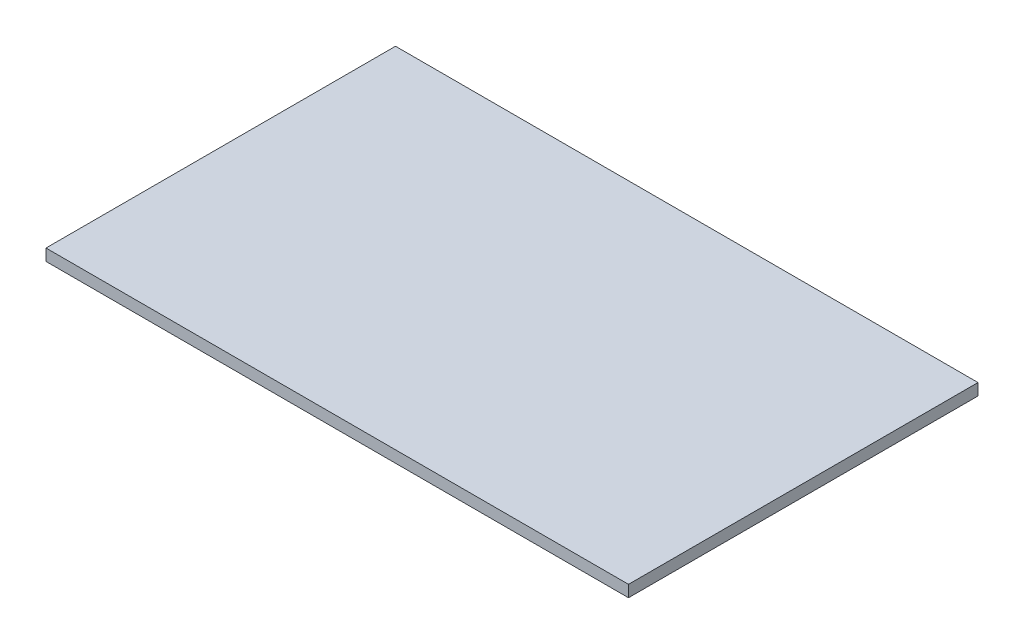
ISO-10303-21;
HEADER;
FILE_DESCRIPTION(('STEP AP214'),'2;1');
FILE_NAME('part.step','',(''),(''),'','','');
FILE_SCHEMA(('AUTOMOTIVE_DESIGN { 1 0 10303 214 1 1 1 1 }'));
ENDSEC;
DATA;
#1=APPLICATION_CONTEXT('core data for automotive mechanical design processes');
#2=APPLICATION_PROTOCOL_DEFINITION('international standard','automotive_design',2000,#1);
#3=PRODUCT_CONTEXT('',#1,'mechanical');
#4=PRODUCT('Part','Part','',(#3));
#5=PRODUCT_RELATED_PRODUCT_CATEGORY('part','',(#4));
#6=PRODUCT_DEFINITION_FORMATION('','',#4);
#7=PRODUCT_DEFINITION_CONTEXT('part definition',#1,'design');
#8=PRODUCT_DEFINITION('design','',#6,#7);
#9=PRODUCT_DEFINITION_SHAPE('','',#8);
#10=(LENGTH_UNIT() NAMED_UNIT(*) SI_UNIT(.MILLI.,.METRE.));
#11=(NAMED_UNIT(*) PLANE_ANGLE_UNIT() SI_UNIT($,.RADIAN.));
#12=(NAMED_UNIT(*) SI_UNIT($,.STERADIAN.) SOLID_ANGLE_UNIT());
#13=UNCERTAINTY_MEASURE_WITH_UNIT(LENGTH_MEASURE(1.E-05),#10,'distance_accuracy_value','');
#14=(GEOMETRIC_REPRESENTATION_CONTEXT(3) GLOBAL_UNCERTAINTY_ASSIGNED_CONTEXT((#13)) GLOBAL_UNIT_ASSIGNED_CONTEXT((#10,
#11,#12)) REPRESENTATION_CONTEXT('',''));
#15=CARTESIAN_POINT('',(0.,0.,0.));
#16=DIRECTION('',(0.,0.,1.));
#17=DIRECTION('',(1.,0.,0.));
#18=AXIS2_PLACEMENT_3D('',#15,#16,#17);
#19=CARTESIAN_POINT('',(-55.030735917634,2.54,-27.9430679789023));
#20=DIRECTION('',(0.,0.,-1.));
#21=DIRECTION('',(-1.,0.,0.));
#22=AXIS2_PLACEMENT_3D('',#19,#20,#21);
#23=PLANE('',#22);
#24=DIRECTION('',(1.,0.,0.));
#25=VECTOR('',#24,1.);
#26=CARTESIAN_POINT('',(-55.030735917634,0.,-27.9430679789023));
#27=LINE('',#26,#25);
#28=CARTESIAN_POINT('',(-55.030735917634,0.,-27.9430679789023));
#29=VERTEX_POINT('',#28);
#30=CARTESIAN_POINT('',(71.969264082366,0.,-27.9430679789023));
#31=VERTEX_POINT('',#30);
#32=EDGE_CURVE('E99',#29,#31,#27,.T.);
#33=ORIENTED_EDGE('',*,*,#32,.F.);
#34=DIRECTION('',(0.,-1.,0.));
#35=VECTOR('',#34,1.);
#36=CARTESIAN_POINT('',(-55.030735917634,2.54,-27.9430679789023));
#37=LINE('',#36,#35);
#38=CARTESIAN_POINT('',(-55.030735917634,2.54,-27.9430679789023));
#39=VERTEX_POINT('',#38);
#40=EDGE_CURVE('E11',#39,#29,#37,.T.);
#41=ORIENTED_EDGE('',*,*,#40,.F.);
#42=DIRECTION('',(1.,0.,0.));
#43=VECTOR('',#42,1.);
#44=CARTESIAN_POINT('',(-55.030735917634,2.54,-27.9430679789023));
#45=LINE('',#44,#43);
#46=CARTESIAN_POINT('',(71.969264082366,2.54,-27.9430679789023));
#47=VERTEX_POINT('',#46);
#48=EDGE_CURVE('E94',#39,#47,#45,.T.);
#49=ORIENTED_EDGE('',*,*,#48,.T.);
#50=DIRECTION('',(0.,-1.,0.));
#51=VECTOR('',#50,1.);
#52=CARTESIAN_POINT('',(71.969264082366,2.54,-27.9430679789023));
#53=LINE('',#52,#51);
#54=EDGE_CURVE('E37',#47,#31,#53,.T.);
#55=ORIENTED_EDGE('',*,*,#54,.T.);
#56=EDGE_LOOP('',(#33,#41,#49,#55));
#57=FACE_BOUND('',#56,.T.);
#58=ADVANCED_FACE('F34',(#57),#23,.T.);
#59=CARTESIAN_POINT('',(-55.030735917634,2.54,-27.9430679789023));
#60=DIRECTION('',(1.,0.,0.));
#61=DIRECTION('',(0.,0.,-1.));
#62=AXIS2_PLACEMENT_3D('',#59,#60,#61);
#63=PLANE('',#62);
#64=DIRECTION('',(0.,0.,1.));
#65=VECTOR('',#64,1.);
#66=CARTESIAN_POINT('',(-55.030735917634,0.,-27.9430679789023));
#67=LINE('',#66,#65);
#68=CARTESIAN_POINT('',(-55.030735917634,0.,48.2569320210978));
#69=VERTEX_POINT('',#68);
#70=EDGE_CURVE('E67',#29,#69,#67,.T.);
#71=ORIENTED_EDGE('',*,*,#70,.T.);
#72=DIRECTION('',(0.,-1.,0.));
#73=VECTOR('',#72,1.);
#74=CARTESIAN_POINT('',(-55.030735917634,2.54,48.2569320210978));
#75=LINE('',#74,#73);
#76=CARTESIAN_POINT('',(-55.030735917634,2.54,48.2569320210978));
#77=VERTEX_POINT('',#76);
#78=EDGE_CURVE('E43',#77,#69,#75,.T.);
#79=ORIENTED_EDGE('',*,*,#78,.F.);
#80=DIRECTION('',(0.,0.,1.));
#81=VECTOR('',#80,1.);
#82=CARTESIAN_POINT('',(-55.030735917634,2.54,-27.9430679789023));
#83=LINE('',#82,#81);
#84=EDGE_CURVE('E84',#39,#77,#83,.T.);
#85=ORIENTED_EDGE('',*,*,#84,.F.);
#86=ORIENTED_EDGE('',*,*,#40,.T.);
#87=EDGE_LOOP('',(#71,#79,#85,#86));
#88=FACE_BOUND('',#87,.T.);
#89=ADVANCED_FACE('F109',(#88),#63,.F.);
#90=CARTESIAN_POINT('',(-55.030735917634,2.54,48.2569320210978));
#91=DIRECTION('',(0.,0.,-1.));
#92=DIRECTION('',(-1.,0.,0.));
#93=AXIS2_PLACEMENT_3D('',#90,#91,#92);
#94=PLANE('',#93);
#95=DIRECTION('',(1.,0.,0.));
#96=VECTOR('',#95,1.);
#97=CARTESIAN_POINT('',(-55.030735917634,0.,48.2569320210978));
#98=LINE('',#97,#96);
#99=CARTESIAN_POINT('',(71.969264082366,0.,48.2569320210978));
#100=VERTEX_POINT('',#99);
#101=EDGE_CURVE('E91',#69,#100,#98,.T.);
#102=ORIENTED_EDGE('',*,*,#101,.T.);
#103=DIRECTION('',(0.,-1.,0.));
#104=VECTOR('',#103,1.);
#105=CARTESIAN_POINT('',(71.969264082366,2.54,48.2569320210978));
#106=LINE('',#105,#104);
#107=CARTESIAN_POINT('',(71.969264082366,2.54,48.2569320210978));
#108=VERTEX_POINT('',#107);
#109=EDGE_CURVE('E88',#108,#100,#106,.T.);
#110=ORIENTED_EDGE('',*,*,#109,.F.);
#111=DIRECTION('',(1.,0.,0.));
#112=VECTOR('',#111,1.);
#113=CARTESIAN_POINT('',(-55.030735917634,2.54,48.2569320210978));
#114=LINE('',#113,#112);
#115=EDGE_CURVE('E79',#77,#108,#114,.T.);
#116=ORIENTED_EDGE('',*,*,#115,.F.);
#117=ORIENTED_EDGE('',*,*,#78,.T.);
#118=EDGE_LOOP('',(#102,#110,#116,#117));
#119=FACE_BOUND('',#118,.T.);
#120=ADVANCED_FACE('F89',(#119),#94,.F.);
#121=CARTESIAN_POINT('',(71.969264082366,2.54,-27.9430679789023));
#122=DIRECTION('',(1.,0.,0.));
#123=DIRECTION('',(0.,0.,-1.));
#124=AXIS2_PLACEMENT_3D('',#121,#122,#123);
#125=PLANE('',#124);
#126=DIRECTION('',(0.,0.,1.));
#127=VECTOR('',#126,1.);
#128=CARTESIAN_POINT('',(71.969264082366,0.,-27.9430679789023));
#129=LINE('',#128,#127);
#130=EDGE_CURVE('E102',#31,#100,#129,.T.);
#131=ORIENTED_EDGE('',*,*,#130,.F.);
#132=ORIENTED_EDGE('',*,*,#54,.F.);
#133=DIRECTION('',(0.,0.,1.));
#134=VECTOR('',#133,1.);
#135=CARTESIAN_POINT('',(71.969264082366,2.54,-27.9430679789023));
#136=LINE('',#135,#134);
#137=EDGE_CURVE('E83',#47,#108,#136,.T.);
#138=ORIENTED_EDGE('',*,*,#137,.T.);
#139=ORIENTED_EDGE('',*,*,#109,.T.);
#140=EDGE_LOOP('',(#131,#132,#138,#139));
#141=FACE_BOUND('',#140,.T.);
#142=ADVANCED_FACE('F93',(#141),#125,.T.);
#143=CARTESIAN_POINT('',(0.,2.54,0.));
#144=DIRECTION('',(0.,-1.,0.));
#145=DIRECTION('',(0.,0.,-1.));
#146=AXIS2_PLACEMENT_3D('',#143,#144,#145);
#147=PLANE('',#146);
#148=ORIENTED_EDGE('',*,*,#48,.F.);
#149=ORIENTED_EDGE('',*,*,#84,.T.);
#150=ORIENTED_EDGE('',*,*,#115,.T.);
#151=ORIENTED_EDGE('',*,*,#137,.F.);
#152=EDGE_LOOP('',(#148,#149,#150,#151));
#153=FACE_BOUND('',#152,.T.);
#154=ADVANCED_FACE('F82',(#153),#147,.F.);
#155=CARTESIAN_POINT('',(0.,0.,0.));
#156=DIRECTION('',(0.,-1.,0.));
#157=DIRECTION('',(0.,0.,-1.));
#158=AXIS2_PLACEMENT_3D('',#155,#156,#157);
#159=PLANE('',#158);
#160=ORIENTED_EDGE('',*,*,#32,.T.);
#161=ORIENTED_EDGE('',*,*,#130,.T.);
#162=ORIENTED_EDGE('',*,*,#101,.F.);
#163=ORIENTED_EDGE('',*,*,#70,.F.);
#164=EDGE_LOOP('',(#160,#161,#162,#163));
#165=FACE_BOUND('',#164,.T.);
#166=ADVANCED_FACE('F107',(#165),#159,.T.);
#167=CLOSED_SHELL('',(#58,#89,#120,#142,#154,#166));
#168=MANIFOLD_SOLID_BREP('B2',#167);
#169=ADVANCED_BREP_SHAPE_REPRESENTATION('',(#18,#168),#14);
#170=SHAPE_DEFINITION_REPRESENTATION(#9,#169);
ENDSEC;
END-ISO-10303-21;
